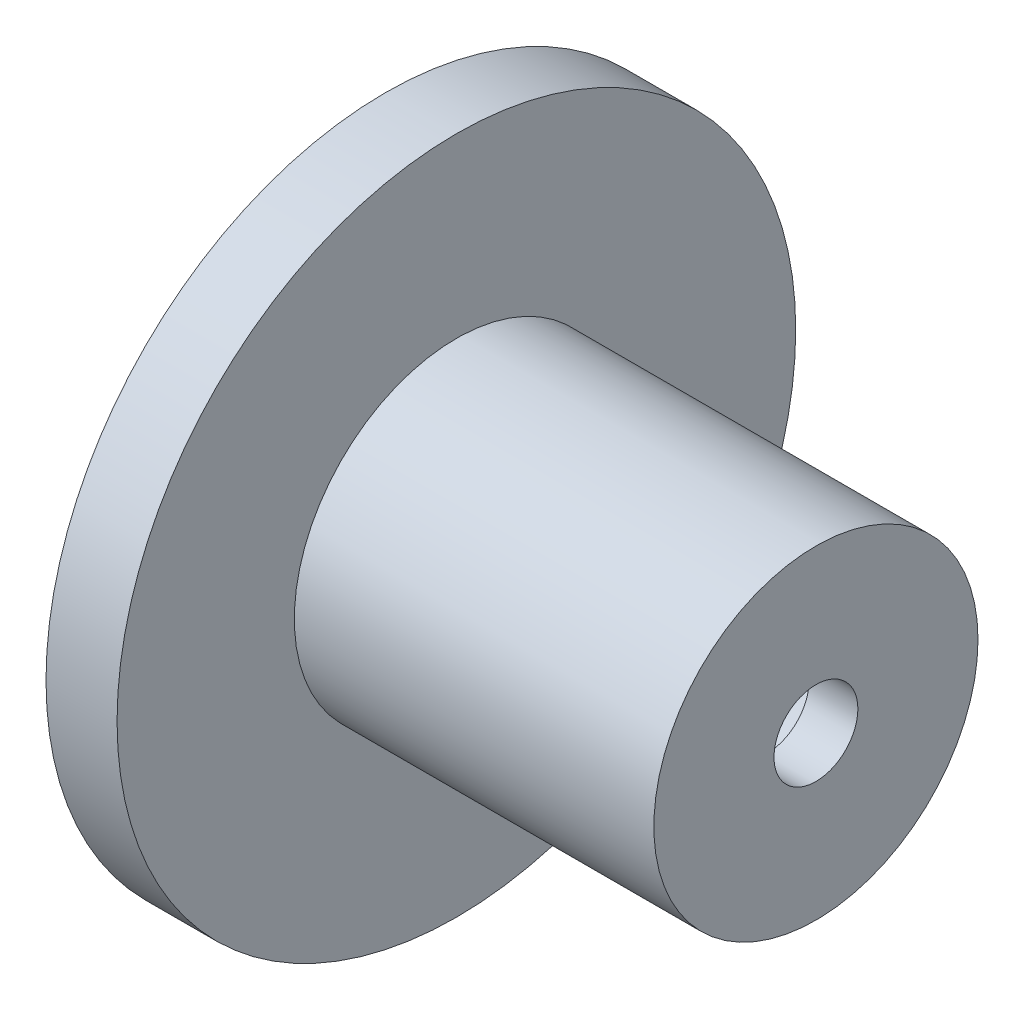
ISO-10303-21;
HEADER;
FILE_DESCRIPTION(('STEP AP214'),'2;1');
FILE_NAME('part.step','',(''),(''),'','','');
FILE_SCHEMA(('AUTOMOTIVE_DESIGN { 1 0 10303 214 1 1 1 1 }'));
ENDSEC;
DATA;
#1=APPLICATION_CONTEXT('core data for automotive mechanical design processes');
#2=APPLICATION_PROTOCOL_DEFINITION('international standard','automotive_design',2000,#1);
#3=PRODUCT_CONTEXT('',#1,'mechanical');
#4=PRODUCT('Part','Part','',(#3));
#5=PRODUCT_RELATED_PRODUCT_CATEGORY('part','',(#4));
#6=PRODUCT_DEFINITION_FORMATION('','',#4);
#7=PRODUCT_DEFINITION_CONTEXT('part definition',#1,'design');
#8=PRODUCT_DEFINITION('design','',#6,#7);
#9=PRODUCT_DEFINITION_SHAPE('','',#8);
#10=(LENGTH_UNIT() NAMED_UNIT(*) SI_UNIT(.MILLI.,.METRE.));
#11=(NAMED_UNIT(*) PLANE_ANGLE_UNIT() SI_UNIT($,.RADIAN.));
#12=(NAMED_UNIT(*) SI_UNIT($,.STERADIAN.) SOLID_ANGLE_UNIT());
#13=UNCERTAINTY_MEASURE_WITH_UNIT(LENGTH_MEASURE(1.E-05),#10,'distance_accuracy_value','');
#14=(GEOMETRIC_REPRESENTATION_CONTEXT(3) GLOBAL_UNCERTAINTY_ASSIGNED_CONTEXT((#13)) GLOBAL_UNIT_ASSIGNED_CONTEXT((#10,
#11,#12)) REPRESENTATION_CONTEXT('',''));
#15=CARTESIAN_POINT('',(0.,0.,0.));
#16=DIRECTION('',(0.,0.,1.));
#17=DIRECTION('',(1.,0.,0.));
#18=AXIS2_PLACEMENT_3D('',#15,#16,#17);
#19=CARTESIAN_POINT('',(38.6706055627595,5.99460540598105,0.));
#20=DIRECTION('',(1.,0.,0.));
#21=DIRECTION('',(0.,0.,-1.));
#22=AXIS2_PLACEMENT_3D('',#19,#20,#21);
#23=PLANE('',#22);
#24=CARTESIAN_POINT('',(38.6706055627595,-2.09382712154138,0.));
#25=DIRECTION('',(1.,0.,0.));
#26=DIRECTION('',(0.,0.,-1.));
#27=AXIS2_PLACEMENT_3D('',#24,#25,#26);
#28=CIRCLE('',#27,8.08843252752243);
#29=CARTESIAN_POINT('',(38.6706055627595,-2.09382712154138,-8.08843252752243));
#30=VERTEX_POINT('',#29);
#31=EDGE_CURVE('E84',#30,#30,#28,.T.);
#32=ORIENTED_EDGE('',*,*,#31,.T.);
#33=EDGE_LOOP('',(#32));
#34=FACE_BOUND('',#33,.T.);
#35=CARTESIAN_POINT('',(38.6706055627595,-2.09382712154138,0.));
#36=DIRECTION('',(1.,0.,0.));
#37=DIRECTION('',(0.,0.,-1.));
#38=AXIS2_PLACEMENT_3D('',#35,#36,#37);
#39=CIRCLE('',#38,2.09382712154138);
#40=CARTESIAN_POINT('',(38.6706055627595,-2.09382712154138,-2.09382712154138));
#41=VERTEX_POINT('',#40);
#42=EDGE_CURVE('E10',#41,#41,#39,.T.);
#43=ORIENTED_EDGE('',*,*,#42,.F.);
#44=EDGE_LOOP('',(#43));
#45=FACE_BOUND('',#44,.T.);
#46=ADVANCED_FACE('F41',(#34,#45),#23,.T.);
#47=CARTESIAN_POINT('',(34.2373126050929,-2.09382712154138,0.));
#48=DIRECTION('',(1.,0.,0.));
#49=DIRECTION('',(0.,0.,-1.));
#50=AXIS2_PLACEMENT_3D('',#47,#48,#49);
#51=CYLINDRICAL_SURFACE('',#50,2.09382712154138);
#52=ORIENTED_EDGE('',*,*,#42,.T.);
#53=EDGE_LOOP('',(#52));
#54=FACE_BOUND('',#53,.T.);
#55=CARTESIAN_POINT('',(36.2373126050929,-2.09382712154138,0.));
#56=DIRECTION('',(1.,0.,0.));
#57=DIRECTION('',(0.,0.,-1.));
#58=AXIS2_PLACEMENT_3D('',#55,#56,#57);
#59=CIRCLE('',#58,2.09382712154138);
#60=CARTESIAN_POINT('',(36.2373126050929,-2.09382712154138,-2.09382712154138));
#61=VERTEX_POINT('',#60);
#62=EDGE_CURVE('E48',#61,#61,#59,.T.);
#63=ORIENTED_EDGE('',*,*,#62,.F.);
#64=EDGE_LOOP('',(#63));
#65=FACE_BOUND('',#64,.T.);
#66=ADVANCED_FACE('F103',(#54,#65),#51,.F.);
#67=CARTESIAN_POINT('',(36.2373126050929,0.,0.));
#68=DIRECTION('',(-1.,0.,0.));
#69=DIRECTION('',(0.,0.,1.));
#70=AXIS2_PLACEMENT_3D('',#67,#68,#69);
#71=PLANE('',#70);
#72=ORIENTED_EDGE('',*,*,#62,.T.);
#73=EDGE_LOOP('',(#72));
#74=FACE_BOUND('',#73,.T.);
#75=CARTESIAN_POINT('',(36.2373126050929,-2.09382712154138,0.));
#76=DIRECTION('',(1.,0.,0.));
#77=DIRECTION('',(0.,0.,-1.));
#78=AXIS2_PLACEMENT_3D('',#75,#76,#77);
#79=CIRCLE('',#78,5.56812384141037);
#80=CARTESIAN_POINT('',(36.2373126050929,-2.09382712154138,-5.56812384141037));
#81=VERTEX_POINT('',#80);
#82=EDGE_CURVE('E53',#81,#81,#79,.T.);
#83=ORIENTED_EDGE('',*,*,#82,.F.);
#84=EDGE_LOOP('',(#83));
#85=FACE_BOUND('',#84,.T.);
#86=ADVANCED_FACE('F107',(#74,#85),#71,.T.);
#87=CARTESIAN_POINT('',(13.4089068717294,-2.09382712154138,0.));
#88=DIRECTION('',(1.,0.,0.));
#89=DIRECTION('',(0.,0.,-1.));
#90=AXIS2_PLACEMENT_3D('',#87,#88,#89);
#91=CONICAL_SURFACE('',#90,5.50000000000001,0.00298416104859582);
#92=ORIENTED_EDGE('',*,*,#82,.T.);
#93=EDGE_LOOP('',(#92));
#94=FACE_BOUND('',#93,.T.);
#95=CARTESIAN_POINT('',(13.4089068717294,-2.09382712154138,0.));
#96=DIRECTION('',(1.,0.,0.));
#97=DIRECTION('',(0.,0.,-1.));
#98=AXIS2_PLACEMENT_3D('',#95,#96,#97);
#99=CIRCLE('',#98,5.50000000000001);
#100=CARTESIAN_POINT('',(13.4089068717294,-2.09382712154138,-5.50000000000001));
#101=VERTEX_POINT('',#100);
#102=EDGE_CURVE('E58',#101,#101,#99,.T.);
#103=ORIENTED_EDGE('',*,*,#102,.F.);
#104=EDGE_LOOP('',(#103));
#105=FACE_BOUND('',#104,.T.);
#106=ADVANCED_FACE('F111',(#94,#105),#91,.F.);
#107=CARTESIAN_POINT('',(13.4089068717294,3.40617287845862,0.));
#108=DIRECTION('',(-1.,0.,0.));
#109=DIRECTION('',(0.,0.,1.));
#110=AXIS2_PLACEMENT_3D('',#107,#108,#109);
#111=PLANE('',#110);
#112=ORIENTED_EDGE('',*,*,#102,.T.);
#113=EDGE_LOOP('',(#112));
#114=FACE_BOUND('',#113,.T.);
#115=CARTESIAN_POINT('',(13.4089068717294,-2.09382712154138,0.));
#116=DIRECTION('',(1.,0.,0.));
#117=DIRECTION('',(0.,0.,-1.));
#118=AXIS2_PLACEMENT_3D('',#115,#116,#117);
#119=CIRCLE('',#118,8.08843252752243);
#120=CARTESIAN_POINT('',(13.4089068717294,-2.09382712154138,-8.08843252752243));
#121=VERTEX_POINT('',#120);
#122=EDGE_CURVE('E64',#121,#121,#119,.T.);
#123=ORIENTED_EDGE('',*,*,#122,.F.);
#124=EDGE_LOOP('',(#123));
#125=FACE_BOUND('',#124,.T.);
#126=ADVANCED_FACE('F117',(#114,#125),#111,.T.);
#127=CARTESIAN_POINT('',(34.2373126050929,-2.09382712154138,0.));
#128=DIRECTION('',(1.,0.,0.));
#129=DIRECTION('',(0.,0.,-1.));
#130=AXIS2_PLACEMENT_3D('',#127,#128,#129);
#131=CYLINDRICAL_SURFACE('',#130,8.08843252752243);
#132=ORIENTED_EDGE('',*,*,#122,.T.);
#133=EDGE_LOOP('',(#132));
#134=FACE_BOUND('',#133,.T.);
#135=CARTESIAN_POINT('',(17.1822175095594,-2.09382712154138,0.));
#136=DIRECTION('',(1.,0.,0.));
#137=DIRECTION('',(0.,0.,-1.));
#138=AXIS2_PLACEMENT_3D('',#135,#136,#137);
#139=CIRCLE('',#138,8.08843252752243);
#140=CARTESIAN_POINT('',(17.1822175095594,-2.09382712154138,-8.08843252752243));
#141=VERTEX_POINT('',#140);
#142=EDGE_CURVE('E68',#141,#141,#139,.T.);
#143=ORIENTED_EDGE('',*,*,#142,.F.);
#144=EDGE_LOOP('',(#143));
#145=FACE_BOUND('',#144,.T.);
#146=ADVANCED_FACE('F121',(#134,#145),#131,.T.);
#147=CARTESIAN_POINT('',(17.1822175095594,5.99460540598105,0.));
#148=DIRECTION('',(-1.,0.,0.));
#149=DIRECTION('',(0.,0.,1.));
#150=AXIS2_PLACEMENT_3D('',#147,#148,#149);
#151=PLANE('',#150);
#152=ORIENTED_EDGE('',*,*,#142,.T.);
#153=EDGE_LOOP('',(#152));
#154=FACE_BOUND('',#153,.T.);
#155=CARTESIAN_POINT('',(17.1822175095594,-2.09382712154138,0.));
#156=DIRECTION('',(1.,0.,0.));
#157=DIRECTION('',(0.,0.,-1.));
#158=AXIS2_PLACEMENT_3D('',#155,#156,#157);
#159=CIRCLE('',#158,16.93469269842);
#160=CARTESIAN_POINT('',(17.1822175095594,-2.09382712154138,-16.93469269842));
#161=VERTEX_POINT('',#160);
#162=EDGE_CURVE('E72',#161,#161,#159,.T.);
#163=ORIENTED_EDGE('',*,*,#162,.F.);
#164=EDGE_LOOP('',(#163));
#165=FACE_BOUND('',#164,.T.);
#166=ADVANCED_FACE('F125',(#154,#165),#151,.T.);
#167=CARTESIAN_POINT('',(34.2373126050929,-2.09382712154138,0.));
#168=DIRECTION('',(1.,0.,0.));
#169=DIRECTION('',(0.,0.,-1.));
#170=AXIS2_PLACEMENT_3D('',#167,#168,#169);
#171=CYLINDRICAL_SURFACE('',#170,16.93469269842);
#172=ORIENTED_EDGE('',*,*,#162,.T.);
#173=EDGE_LOOP('',(#172));
#174=FACE_BOUND('',#173,.T.);
#175=CARTESIAN_POINT('',(20.7281098435247,-2.09382712154138,0.));
#176=DIRECTION('',(1.,0.,0.));
#177=DIRECTION('',(0.,0.,-1.));
#178=AXIS2_PLACEMENT_3D('',#175,#176,#177);
#179=CIRCLE('',#178,16.93469269842);
#180=CARTESIAN_POINT('',(20.7281098435247,-2.09382712154138,-16.93469269842));
#181=VERTEX_POINT('',#180);
#182=EDGE_CURVE('E76',#181,#181,#179,.T.);
#183=ORIENTED_EDGE('',*,*,#182,.F.);
#184=EDGE_LOOP('',(#183));
#185=FACE_BOUND('',#184,.T.);
#186=ADVANCED_FACE('F99',(#174,#185),#171,.T.);
#187=CARTESIAN_POINT('',(20.7281098435247,14.8408655768786,0.));
#188=DIRECTION('',(1.,0.,0.));
#189=DIRECTION('',(0.,0.,-1.));
#190=AXIS2_PLACEMENT_3D('',#187,#188,#189);
#191=PLANE('',#190);
#192=ORIENTED_EDGE('',*,*,#182,.T.);
#193=EDGE_LOOP('',(#192));
#194=FACE_BOUND('',#193,.T.);
#195=CARTESIAN_POINT('',(20.7281098435247,-2.09382712154138,0.));
#196=DIRECTION('',(1.,0.,0.));
#197=DIRECTION('',(0.,0.,-1.));
#198=AXIS2_PLACEMENT_3D('',#195,#196,#197);
#199=CIRCLE('',#198,8.08843252752243);
#200=CARTESIAN_POINT('',(20.7281098435247,-2.09382712154138,-8.08843252752243));
#201=VERTEX_POINT('',#200);
#202=EDGE_CURVE('E80',#201,#201,#199,.T.);
#203=ORIENTED_EDGE('',*,*,#202,.F.);
#204=EDGE_LOOP('',(#203));
#205=FACE_BOUND('',#204,.T.);
#206=ADVANCED_FACE('F93',(#194,#205),#191,.T.);
#207=CARTESIAN_POINT('',(34.2373126050929,-2.09382712154138,0.));
#208=DIRECTION('',(1.,0.,0.));
#209=DIRECTION('',(0.,0.,-1.));
#210=AXIS2_PLACEMENT_3D('',#207,#208,#209);
#211=CYLINDRICAL_SURFACE('',#210,8.08843252752243);
#212=ORIENTED_EDGE('',*,*,#202,.T.);
#213=EDGE_LOOP('',(#212));
#214=FACE_BOUND('',#213,.T.);
#215=ORIENTED_EDGE('',*,*,#31,.F.);
#216=EDGE_LOOP('',(#215));
#217=FACE_BOUND('',#216,.T.);
#218=ADVANCED_FACE('F91',(#214,#217),#211,.T.);
#219=CLOSED_SHELL('',(#46,#66,#86,#106,#126,#146,#166,#186,#206,#218));
#220=MANIFOLD_SOLID_BREP('B2',#219);
#221=ADVANCED_BREP_SHAPE_REPRESENTATION('',(#18,#220),#14);
#222=SHAPE_DEFINITION_REPRESENTATION(#9,#221);
ENDSEC;
END-ISO-10303-21;
